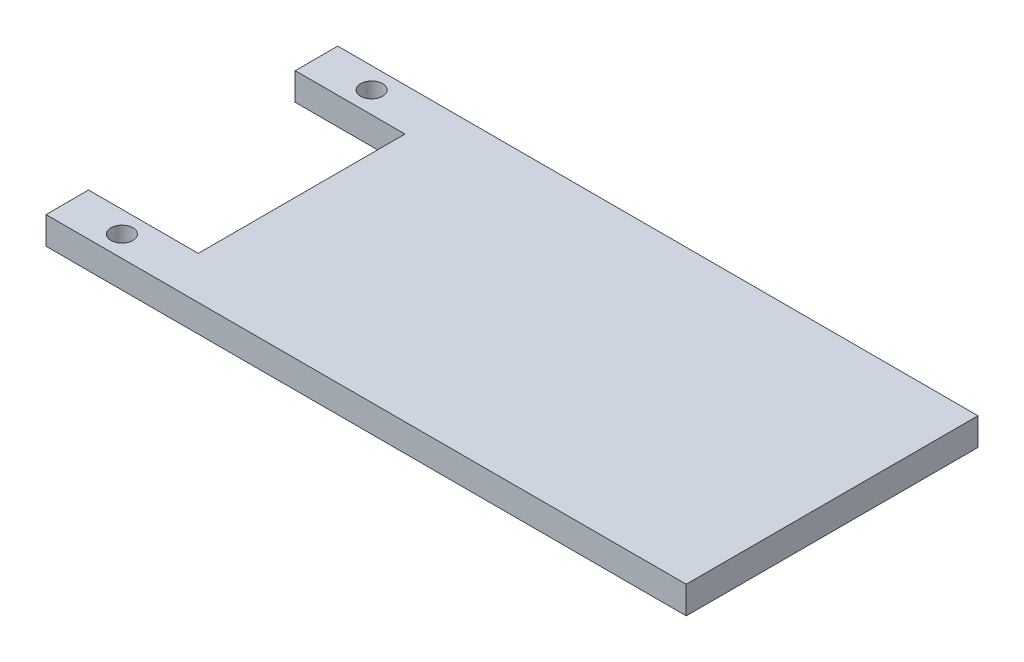
ISO-10303-21;
HEADER;
FILE_DESCRIPTION(('STEP AP214'),'2;1');
FILE_NAME('part.step','',(''),(''),'','','');
FILE_SCHEMA(('AUTOMOTIVE_DESIGN { 1 0 10303 214 1 1 1 1 }'));
ENDSEC;
DATA;
#1=APPLICATION_CONTEXT('core data for automotive mechanical design processes');
#2=APPLICATION_PROTOCOL_DEFINITION('international standard','automotive_design',2000,#1);
#3=PRODUCT_CONTEXT('',#1,'mechanical');
#4=PRODUCT('Part','Part','',(#3));
#5=PRODUCT_RELATED_PRODUCT_CATEGORY('part','',(#4));
#6=PRODUCT_DEFINITION_FORMATION('','',#4);
#7=PRODUCT_DEFINITION_CONTEXT('part definition',#1,'design');
#8=PRODUCT_DEFINITION('design','',#6,#7);
#9=PRODUCT_DEFINITION_SHAPE('','',#8);
#10=(LENGTH_UNIT() NAMED_UNIT(*) SI_UNIT(.MILLI.,.METRE.));
#11=(NAMED_UNIT(*) PLANE_ANGLE_UNIT() SI_UNIT($,.RADIAN.));
#12=(NAMED_UNIT(*) SI_UNIT($,.STERADIAN.) SOLID_ANGLE_UNIT());
#13=UNCERTAINTY_MEASURE_WITH_UNIT(LENGTH_MEASURE(1.E-05),#10,'distance_accuracy_value','');
#14=(GEOMETRIC_REPRESENTATION_CONTEXT(3) GLOBAL_UNCERTAINTY_ASSIGNED_CONTEXT((#13)) GLOBAL_UNIT_ASSIGNED_CONTEXT((#10,
#11,#12)) REPRESENTATION_CONTEXT('',''));
#15=CARTESIAN_POINT('',(0.,0.,0.));
#16=DIRECTION('',(0.,0.,1.));
#17=DIRECTION('',(1.,0.,0.));
#18=AXIS2_PLACEMENT_3D('',#15,#16,#17);
#19=CARTESIAN_POINT('',(-35.,3.,15.95));
#20=DIRECTION('',(1.,0.,0.));
#21=DIRECTION('',(0.,0.,-1.));
#22=AXIS2_PLACEMENT_3D('',#19,#20,#21);
#23=PLANE('',#22);
#24=DIRECTION('',(0.,0.,1.));
#25=VECTOR('',#24,1.);
#26=CARTESIAN_POINT('',(-35.,3.,15.95));
#27=LINE('',#26,#25);
#28=CARTESIAN_POINT('',(-35.,3.,11.3));
#29=VERTEX_POINT('',#28);
#30=CARTESIAN_POINT('',(-35.,3.,15.95));
#31=VERTEX_POINT('',#30);
#32=EDGE_CURVE('E156',#29,#31,#27,.T.);
#33=ORIENTED_EDGE('',*,*,#32,.F.);
#34=DIRECTION('',(0.,-1.,0.));
#35=VECTOR('',#34,1.);
#36=CARTESIAN_POINT('',(-35.,3.,11.3));
#37=LINE('',#36,#35);
#38=CARTESIAN_POINT('',(-35.,0.,11.3));
#39=VERTEX_POINT('',#38);
#40=EDGE_CURVE('E137',#29,#39,#37,.T.);
#41=ORIENTED_EDGE('',*,*,#40,.T.);
#42=DIRECTION('',(0.,0.,1.));
#43=VECTOR('',#42,1.);
#44=CARTESIAN_POINT('',(-35.,0.,15.95));
#45=LINE('',#44,#43);
#46=CARTESIAN_POINT('',(-35.,0.,15.95));
#47=VERTEX_POINT('',#46);
#48=EDGE_CURVE('E166',#39,#47,#45,.T.);
#49=ORIENTED_EDGE('',*,*,#48,.T.);
#50=DIRECTION('',(0.,-1.,0.));
#51=VECTOR('',#50,1.);
#52=CARTESIAN_POINT('',(-35.,3.,15.95));
#53=LINE('',#52,#51);
#54=EDGE_CURVE('E171',#31,#47,#53,.T.);
#55=ORIENTED_EDGE('',*,*,#54,.F.);
#56=EDGE_LOOP('',(#33,#41,#49,#55));
#57=FACE_BOUND('',#56,.T.);
#58=ADVANCED_FACE('F33',(#57),#23,.F.);
#59=CARTESIAN_POINT('',(35.,3.,15.95));
#60=DIRECTION('',(-1.,0.,0.));
#61=DIRECTION('',(0.,0.,1.));
#62=AXIS2_PLACEMENT_3D('',#59,#60,#61);
#63=PLANE('',#62);
#64=DIRECTION('',(0.,0.,-1.));
#65=VECTOR('',#64,1.);
#66=CARTESIAN_POINT('',(35.,0.,15.95));
#67=LINE('',#66,#65);
#68=CARTESIAN_POINT('',(35.,0.,15.95));
#69=VERTEX_POINT('',#68);
#70=CARTESIAN_POINT('',(35.,0.,-15.95));
#71=VERTEX_POINT('',#70);
#72=EDGE_CURVE('E150',#69,#71,#67,.T.);
#73=ORIENTED_EDGE('',*,*,#72,.T.);
#74=DIRECTION('',(0.,-1.,0.));
#75=VECTOR('',#74,1.);
#76=CARTESIAN_POINT('',(35.,3.,-15.95));
#77=LINE('',#76,#75);
#78=CARTESIAN_POINT('',(35.,3.,-15.95));
#79=VERTEX_POINT('',#78);
#80=EDGE_CURVE('E41',#79,#71,#77,.T.);
#81=ORIENTED_EDGE('',*,*,#80,.F.);
#82=DIRECTION('',(0.,0.,-1.));
#83=VECTOR('',#82,1.);
#84=CARTESIAN_POINT('',(35.,3.,15.95));
#85=LINE('',#84,#83);
#86=CARTESIAN_POINT('',(35.,3.,15.95));
#87=VERTEX_POINT('',#86);
#88=EDGE_CURVE('E153',#87,#79,#85,.T.);
#89=ORIENTED_EDGE('',*,*,#88,.F.);
#90=DIRECTION('',(0.,-1.,0.));
#91=VECTOR('',#90,1.);
#92=CARTESIAN_POINT('',(35.,3.,15.95));
#93=LINE('',#92,#91);
#94=EDGE_CURVE('E161',#87,#69,#93,.T.);
#95=ORIENTED_EDGE('',*,*,#94,.T.);
#96=EDGE_LOOP('',(#73,#81,#89,#95));
#97=FACE_BOUND('',#96,.T.);
#98=ADVANCED_FACE('F35',(#97),#63,.F.);
#99=CARTESIAN_POINT('',(-35.,3.,-15.95));
#100=DIRECTION('',(0.,0.,1.));
#101=DIRECTION('',(1.,0.,0.));
#102=AXIS2_PLACEMENT_3D('',#99,#100,#101);
#103=PLANE('',#102);
#104=DIRECTION('',(-1.,0.,0.));
#105=VECTOR('',#104,1.);
#106=CARTESIAN_POINT('',(-35.,0.,-15.95));
#107=LINE('',#106,#105);
#108=CARTESIAN_POINT('',(-35.,0.,-15.95));
#109=VERTEX_POINT('',#108);
#110=EDGE_CURVE('E164',#71,#109,#107,.T.);
#111=ORIENTED_EDGE('',*,*,#110,.T.);
#112=DIRECTION('',(0.,-1.,0.));
#113=VECTOR('',#112,1.);
#114=CARTESIAN_POINT('',(-35.,3.,-15.95));
#115=LINE('',#114,#113);
#116=CARTESIAN_POINT('',(-35.,3.,-15.95));
#117=VERTEX_POINT('',#116);
#118=EDGE_CURVE('E173',#117,#109,#115,.T.);
#119=ORIENTED_EDGE('',*,*,#118,.F.);
#120=DIRECTION('',(-1.,0.,0.));
#121=VECTOR('',#120,1.);
#122=CARTESIAN_POINT('',(-35.,3.,-15.95));
#123=LINE('',#122,#121);
#124=EDGE_CURVE('E86',#79,#117,#123,.T.);
#125=ORIENTED_EDGE('',*,*,#124,.F.);
#126=ORIENTED_EDGE('',*,*,#80,.T.);
#127=EDGE_LOOP('',(#111,#119,#125,#126));
#128=FACE_BOUND('',#127,.T.);
#129=ADVANCED_FACE('F176',(#128),#103,.F.);
#130=CARTESIAN_POINT('',(-35.,0.,-11.3));
#131=VERTEX_POINT('',#130);
#132=EDGE_CURVE('E167',#109,#131,#45,.T.);
#133=ORIENTED_EDGE('',*,*,#132,.T.);
#134=DIRECTION('',(0.,1.,0.));
#135=VECTOR('',#134,1.);
#136=CARTESIAN_POINT('',(-35.,3.,-11.3));
#137=LINE('',#136,#135);
#138=CARTESIAN_POINT('',(-35.,3.,-11.3));
#139=VERTEX_POINT('',#138);
#140=EDGE_CURVE('E48',#131,#139,#137,.T.);
#141=ORIENTED_EDGE('',*,*,#140,.T.);
#142=EDGE_CURVE('E157',#117,#139,#27,.T.);
#143=ORIENTED_EDGE('',*,*,#142,.F.);
#144=ORIENTED_EDGE('',*,*,#118,.T.);
#145=EDGE_LOOP('',(#133,#141,#143,#144));
#146=FACE_BOUND('',#145,.T.);
#147=ADVANCED_FACE('F181',(#146),#23,.F.);
#148=CARTESIAN_POINT('',(-35.,3.,15.95));
#149=DIRECTION('',(0.,0.,-1.));
#150=DIRECTION('',(-1.,0.,0.));
#151=AXIS2_PLACEMENT_3D('',#148,#149,#150);
#152=PLANE('',#151);
#153=DIRECTION('',(1.,0.,0.));
#154=VECTOR('',#153,1.);
#155=CARTESIAN_POINT('',(-35.,0.,15.95));
#156=LINE('',#155,#154);
#157=EDGE_CURVE('E78',#47,#69,#156,.T.);
#158=ORIENTED_EDGE('',*,*,#157,.T.);
#159=ORIENTED_EDGE('',*,*,#94,.F.);
#160=DIRECTION('',(1.,0.,0.));
#161=VECTOR('',#160,1.);
#162=CARTESIAN_POINT('',(-35.,3.,15.95));
#163=LINE('',#162,#161);
#164=EDGE_CURVE('E57',#31,#87,#163,.T.);
#165=ORIENTED_EDGE('',*,*,#164,.F.);
#166=ORIENTED_EDGE('',*,*,#54,.T.);
#167=EDGE_LOOP('',(#158,#159,#165,#166));
#168=FACE_BOUND('',#167,.T.);
#169=ADVANCED_FACE('F189',(#168),#152,.F.);
#170=CARTESIAN_POINT('',(0.,3.,0.));
#171=DIRECTION('',(0.,-1.,0.));
#172=DIRECTION('',(0.,0.,-1.));
#173=AXIS2_PLACEMENT_3D('',#170,#171,#172);
#174=PLANE('',#173);
#175=CARTESIAN_POINT('',(-29.,3.,13.65));
#176=DIRECTION('',(0.,-1.,0.));
#177=DIRECTION('',(0.,0.,-1.));
#178=AXIS2_PLACEMENT_3D('',#175,#176,#177);
#179=CIRCLE('',#178,1.2);
#180=CARTESIAN_POINT('',(-29.,3.,12.45));
#181=VERTEX_POINT('',#180);
#182=EDGE_CURVE('E140',#181,#181,#179,.T.);
#183=ORIENTED_EDGE('',*,*,#182,.T.);
#184=EDGE_LOOP('',(#183));
#185=FACE_BOUND('',#184,.T.);
#186=CARTESIAN_POINT('',(-29.,3.,-13.65));
#187=DIRECTION('',(0.,1.,0.));
#188=DIRECTION('',(0.,0.,1.));
#189=AXIS2_PLACEMENT_3D('',#186,#187,#188);
#190=CIRCLE('',#189,1.2);
#191=CARTESIAN_POINT('',(-29.,3.,-12.45));
#192=VERTEX_POINT('',#191);
#193=EDGE_CURVE('E144',#192,#192,#190,.T.);
#194=ORIENTED_EDGE('',*,*,#193,.F.);
#195=EDGE_LOOP('',(#194));
#196=FACE_BOUND('',#195,.T.);
#197=DIRECTION('',(0.,0.,-1.));
#198=VECTOR('',#197,1.);
#199=CARTESIAN_POINT('',(-23.,3.,11.3));
#200=LINE('',#199,#198);
#201=CARTESIAN_POINT('',(-23.,3.,11.3));
#202=VERTEX_POINT('',#201);
#203=CARTESIAN_POINT('',(-23.,3.,-11.3));
#204=VERTEX_POINT('',#203);
#205=EDGE_CURVE('E115',#202,#204,#200,.T.);
#206=ORIENTED_EDGE('',*,*,#205,.F.);
#207=DIRECTION('',(1.,0.,0.));
#208=VECTOR('',#207,1.);
#209=CARTESIAN_POINT('',(-47.,3.,11.3));
#210=LINE('',#209,#208);
#211=EDGE_CURVE('E128',#29,#202,#210,.T.);
#212=ORIENTED_EDGE('',*,*,#211,.F.);
#213=ORIENTED_EDGE('',*,*,#32,.T.);
#214=ORIENTED_EDGE('',*,*,#164,.T.);
#215=ORIENTED_EDGE('',*,*,#88,.T.);
#216=ORIENTED_EDGE('',*,*,#124,.T.);
#217=ORIENTED_EDGE('',*,*,#142,.T.);
#218=DIRECTION('',(-1.,0.,0.));
#219=VECTOR('',#218,1.);
#220=CARTESIAN_POINT('',(-47.,3.,-11.3));
#221=LINE('',#220,#219);
#222=EDGE_CURVE('E130',#204,#139,#221,.T.);
#223=ORIENTED_EDGE('',*,*,#222,.F.);
#224=EDGE_LOOP('',(#206,#212,#213,#214,#215,#216,#217,#223));
#225=FACE_BOUND('',#224,.T.);
#226=ADVANCED_FACE('F183',(#185,#196,#225),#174,.F.);
#227=CARTESIAN_POINT('',(0.,0.,0.));
#228=DIRECTION('',(0.,-1.,0.));
#229=DIRECTION('',(0.,0.,-1.));
#230=AXIS2_PLACEMENT_3D('',#227,#228,#229);
#231=PLANE('',#230);
#232=DIRECTION('',(-1.,0.,0.));
#233=VECTOR('',#232,1.);
#234=CARTESIAN_POINT('',(0.,0.,11.3));
#235=LINE('',#234,#233);
#236=CARTESIAN_POINT('',(-23.,0.,11.3));
#237=VERTEX_POINT('',#236);
#238=EDGE_CURVE('E11',#237,#39,#235,.T.);
#239=ORIENTED_EDGE('',*,*,#238,.F.);
#240=DIRECTION('',(0.,0.,-1.));
#241=VECTOR('',#240,1.);
#242=CARTESIAN_POINT('',(-23.,0.,11.3));
#243=LINE('',#242,#241);
#244=CARTESIAN_POINT('',(-23.,0.,-11.3));
#245=VERTEX_POINT('',#244);
#246=EDGE_CURVE('E112',#237,#245,#243,.T.);
#247=ORIENTED_EDGE('',*,*,#246,.T.);
#248=DIRECTION('',(-1.,0.,0.));
#249=VECTOR('',#248,1.);
#250=CARTESIAN_POINT('',(-47.,0.,-11.3));
#251=LINE('',#250,#249);
#252=EDGE_CURVE('E118',#245,#131,#251,.T.);
#253=ORIENTED_EDGE('',*,*,#252,.T.);
#254=ORIENTED_EDGE('',*,*,#132,.F.);
#255=ORIENTED_EDGE('',*,*,#110,.F.);
#256=ORIENTED_EDGE('',*,*,#72,.F.);
#257=ORIENTED_EDGE('',*,*,#157,.F.);
#258=ORIENTED_EDGE('',*,*,#48,.F.);
#259=EDGE_LOOP('',(#239,#247,#253,#254,#255,#256,#257,#258));
#260=FACE_BOUND('',#259,.T.);
#261=CARTESIAN_POINT('',(-29.,0.,13.65));
#262=DIRECTION('',(0.,-1.,0.));
#263=DIRECTION('',(0.,0.,-1.));
#264=AXIS2_PLACEMENT_3D('',#261,#262,#263);
#265=CIRCLE('',#264,1.2);
#266=CARTESIAN_POINT('',(-29.,0.,12.45));
#267=VERTEX_POINT('',#266);
#268=EDGE_CURVE('E141',#267,#267,#265,.T.);
#269=ORIENTED_EDGE('',*,*,#268,.F.);
#270=EDGE_LOOP('',(#269));
#271=FACE_BOUND('',#270,.T.);
#272=CARTESIAN_POINT('',(-29.,0.,-13.65));
#273=DIRECTION('',(0.,1.,0.));
#274=DIRECTION('',(0.,0.,1.));
#275=AXIS2_PLACEMENT_3D('',#272,#273,#274);
#276=CIRCLE('',#275,1.2);
#277=CARTESIAN_POINT('',(-29.,0.,-12.45));
#278=VERTEX_POINT('',#277);
#279=EDGE_CURVE('E147',#278,#278,#276,.T.);
#280=ORIENTED_EDGE('',*,*,#279,.T.);
#281=EDGE_LOOP('',(#280));
#282=FACE_BOUND('',#281,.T.);
#283=ADVANCED_FACE('F125',(#260,#271,#282),#231,.T.);
#284=CARTESIAN_POINT('',(-29.,0.,-13.65));
#285=DIRECTION('',(0.,1.,0.));
#286=DIRECTION('',(0.,0.,1.));
#287=AXIS2_PLACEMENT_3D('',#284,#285,#286);
#288=CYLINDRICAL_SURFACE('',#287,1.2);
#289=ORIENTED_EDGE('',*,*,#279,.F.);
#290=EDGE_LOOP('',(#289));
#291=FACE_BOUND('',#290,.T.);
#292=ORIENTED_EDGE('',*,*,#193,.T.);
#293=EDGE_LOOP('',(#292));
#294=FACE_BOUND('',#293,.T.);
#295=ADVANCED_FACE('F232',(#291,#294),#288,.F.);
#296=CARTESIAN_POINT('',(-29.,0.,13.65));
#297=DIRECTION('',(0.,1.,0.));
#298=DIRECTION('',(0.,0.,1.));
#299=AXIS2_PLACEMENT_3D('',#296,#297,#298);
#300=CYLINDRICAL_SURFACE('',#299,1.2);
#301=ORIENTED_EDGE('',*,*,#268,.T.);
#302=EDGE_LOOP('',(#301));
#303=FACE_BOUND('',#302,.T.);
#304=ORIENTED_EDGE('',*,*,#182,.F.);
#305=EDGE_LOOP('',(#304));
#306=FACE_BOUND('',#305,.T.);
#307=ADVANCED_FACE('F243',(#303,#306),#300,.F.);
#308=CARTESIAN_POINT('',(-47.,0.,11.3));
#309=DIRECTION('',(0.,0.,1.));
#310=DIRECTION('',(1.,0.,0.));
#311=AXIS2_PLACEMENT_3D('',#308,#309,#310);
#312=PLANE('',#311);
#313=ORIENTED_EDGE('',*,*,#211,.T.);
#314=DIRECTION('',(0.,1.,0.));
#315=VECTOR('',#314,1.);
#316=CARTESIAN_POINT('',(-23.,0.,11.3));
#317=LINE('',#316,#315);
#318=EDGE_CURVE('E117',#237,#202,#317,.T.);
#319=ORIENTED_EDGE('',*,*,#318,.F.);
#320=ORIENTED_EDGE('',*,*,#238,.T.);
#321=ORIENTED_EDGE('',*,*,#40,.F.);
#322=EDGE_LOOP('',(#313,#319,#320,#321));
#323=FACE_BOUND('',#322,.T.);
#324=ADVANCED_FACE('F238',(#323),#312,.F.);
#325=CARTESIAN_POINT('',(-47.,0.,-11.3));
#326=DIRECTION('',(0.,0.,-1.));
#327=DIRECTION('',(-1.,0.,0.));
#328=AXIS2_PLACEMENT_3D('',#325,#326,#327);
#329=PLANE('',#328);
#330=ORIENTED_EDGE('',*,*,#252,.F.);
#331=DIRECTION('',(0.,1.,0.));
#332=VECTOR('',#331,1.);
#333=CARTESIAN_POINT('',(-23.,0.,-11.3));
#334=LINE('',#333,#332);
#335=EDGE_CURVE('E108',#245,#204,#334,.T.);
#336=ORIENTED_EDGE('',*,*,#335,.T.);
#337=ORIENTED_EDGE('',*,*,#222,.T.);
#338=ORIENTED_EDGE('',*,*,#140,.F.);
#339=EDGE_LOOP('',(#330,#336,#337,#338));
#340=FACE_BOUND('',#339,.T.);
#341=ADVANCED_FACE('F120',(#340),#329,.F.);
#342=CARTESIAN_POINT('',(-23.,0.,11.3));
#343=DIRECTION('',(1.,0.,0.));
#344=DIRECTION('',(0.,0.,-1.));
#345=AXIS2_PLACEMENT_3D('',#342,#343,#344);
#346=PLANE('',#345);
#347=ORIENTED_EDGE('',*,*,#205,.T.);
#348=ORIENTED_EDGE('',*,*,#335,.F.);
#349=ORIENTED_EDGE('',*,*,#246,.F.);
#350=ORIENTED_EDGE('',*,*,#318,.T.);
#351=EDGE_LOOP('',(#347,#348,#349,#350));
#352=FACE_BOUND('',#351,.T.);
#353=ADVANCED_FACE('F109',(#352),#346,.F.);
#354=CLOSED_SHELL('',(#58,#98,#129,#147,#169,#226,#283,#295,#307,#324,#341,#353));
#355=MANIFOLD_SOLID_BREP('B2',#354);
#356=ADVANCED_BREP_SHAPE_REPRESENTATION('',(#18,#355),#14);
#357=SHAPE_DEFINITION_REPRESENTATION(#9,#356);
ENDSEC;
END-ISO-10303-21;
